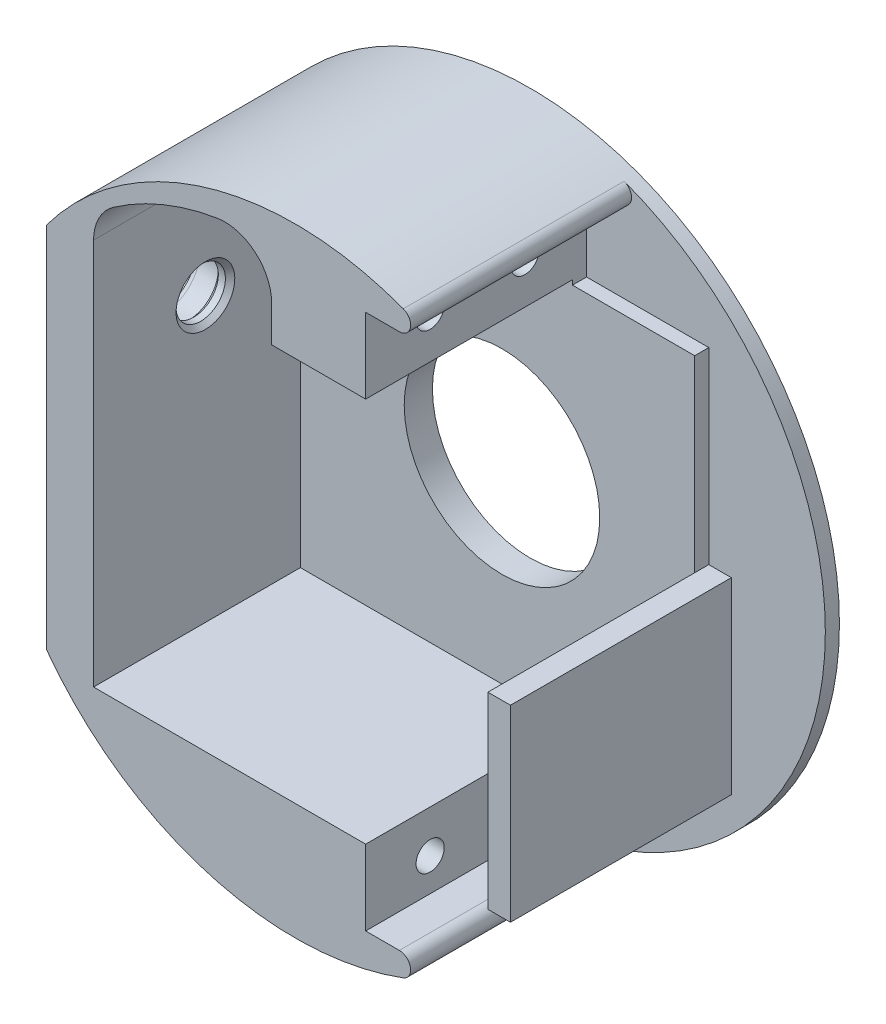
ISO-10303-21;
HEADER;
FILE_DESCRIPTION(('STEP AP214'),'2;1');
FILE_NAME('part.step','',(''),(''),'','','');
FILE_SCHEMA(('AUTOMOTIVE_DESIGN { 1 0 10303 214 1 1 1 1 }'));
ENDSEC;
DATA;
#1=APPLICATION_CONTEXT('core data for automotive mechanical design processes');
#2=APPLICATION_PROTOCOL_DEFINITION('international standard','automotive_design',2000,#1);
#3=PRODUCT_CONTEXT('',#1,'mechanical');
#4=PRODUCT('Part','Part','',(#3));
#5=PRODUCT_RELATED_PRODUCT_CATEGORY('part','',(#4));
#6=PRODUCT_DEFINITION_FORMATION('','',#4);
#7=PRODUCT_DEFINITION_CONTEXT('part definition',#1,'design');
#8=PRODUCT_DEFINITION('design','',#6,#7);
#9=PRODUCT_DEFINITION_SHAPE('','',#8);
#10=(LENGTH_UNIT() NAMED_UNIT(*) SI_UNIT(.MILLI.,.METRE.));
#11=(NAMED_UNIT(*) PLANE_ANGLE_UNIT() SI_UNIT($,.RADIAN.));
#12=(NAMED_UNIT(*) SI_UNIT($,.STERADIAN.) SOLID_ANGLE_UNIT());
#13=UNCERTAINTY_MEASURE_WITH_UNIT(LENGTH_MEASURE(1.E-05),#10,'distance_accuracy_value','');
#14=(GEOMETRIC_REPRESENTATION_CONTEXT(3) GLOBAL_UNCERTAINTY_ASSIGNED_CONTEXT((#13)) GLOBAL_UNIT_ASSIGNED_CONTEXT((#10,
#11,#12)) REPRESENTATION_CONTEXT('',''));
#15=CARTESIAN_POINT('',(0.,0.,0.));
#16=DIRECTION('',(0.,0.,1.));
#17=DIRECTION('',(1.,0.,0.));
#18=AXIS2_PLACEMENT_3D('',#15,#16,#17);
#19=CARTESIAN_POINT('',(9.61999999999999,10.,25.));
#20=DIRECTION('',(0.,0.,-1.));
#21=DIRECTION('',(-1.,0.,0.));
#22=AXIS2_PLACEMENT_3D('',#19,#20,#21);
#23=CYLINDRICAL_SURFACE('',#22,10.4);
#24=CARTESIAN_POINT('',(9.61999999999999,10.,0.));
#25=DIRECTION('',(0.,0.,1.));
#26=DIRECTION('',(1.,0.,0.));
#27=AXIS2_PLACEMENT_3D('',#24,#25,#26);
#28=CIRCLE('',#27,10.4);
#29=CARTESIAN_POINT('',(20.02,10.,0.));
#30=VERTEX_POINT('',#29);
#31=EDGE_CURVE('E348',#30,#30,#28,.T.);
#32=ORIENTED_EDGE('',*,*,#31,.F.);
#33=EDGE_LOOP('',(#32));
#34=FACE_BOUND('',#33,.T.);
#35=CARTESIAN_POINT('',(9.61999999999999,10.,3.));
#36=DIRECTION('',(0.,0.,1.));
#37=DIRECTION('',(1.,0.,0.));
#38=AXIS2_PLACEMENT_3D('',#35,#36,#37);
#39=CIRCLE('',#38,10.4);
#40=CARTESIAN_POINT('',(20.02,10.,3.));
#41=VERTEX_POINT('',#40);
#42=EDGE_CURVE('E260',#41,#41,#39,.T.);
#43=ORIENTED_EDGE('',*,*,#42,.T.);
#44=EDGE_LOOP('',(#43));
#45=FACE_BOUND('',#44,.T.);
#46=ADVANCED_FACE('F36',(#34,#45),#23,.F.);
#47=CARTESIAN_POINT('',(9.61999999999999,10.,25.));
#48=DIRECTION('',(0.,0.,1.));
#49=DIRECTION('',(1.,0.,0.));
#50=AXIS2_PLACEMENT_3D('',#47,#48,#49);
#51=PLANE('',#50);
#52=DIRECTION('',(-1.,0.,0.));
#53=VECTOR('',#52,1.);
#54=CARTESIAN_POINT('',(17.12,38.5,25.));
#55=LINE('',#54,#53);
#56=CARTESIAN_POINT('',(20.7015161417561,38.5,25.));
#57=VERTEX_POINT('',#56);
#58=CARTESIAN_POINT('',(17.12,38.5,25.));
#59=VERTEX_POINT('',#58);
#60=EDGE_CURVE('E308',#57,#59,#55,.T.);
#61=ORIENTED_EDGE('',*,*,#60,.F.);
#62=CARTESIAN_POINT('',(20.7015161417561,39.7,25.));
#63=DIRECTION('',(0.,0.,1.));
#64=DIRECTION('',(1.,0.,0.));
#65=AXIS2_PLACEMENT_3D('',#62,#63,#64);
#66=CIRCLE('',#65,1.2);
#67=CARTESIAN_POINT('',(21.121005711791,40.8242902208202,25.));
#68=VERTEX_POINT('',#67);
#69=EDGE_CURVE('E382',#57,#68,#66,.T.);
#70=ORIENTED_EDGE('',*,*,#69,.T.);
#71=CARTESIAN_POINT('',(9.61999999999999,10.,25.));
#72=DIRECTION('',(0.,0.,1.));
#73=DIRECTION('',(1.,0.,0.));
#74=AXIS2_PLACEMENT_3D('',#71,#72,#73);
#75=CIRCLE('',#74,32.9);
#76=CARTESIAN_POINT('',(-16.8282280902542,29.5678621950863,25.));
#77=VERTEX_POINT('',#76);
#78=EDGE_CURVE('E206',#68,#77,#75,.T.);
#79=ORIENTED_EDGE('',*,*,#78,.T.);
#80=DIRECTION('',(0.,1.,0.));
#81=VECTOR('',#80,1.);
#82=CARTESIAN_POINT('',(-16.8282280902542,-9.56786219508629,25.));
#83=LINE('',#82,#81);
#84=CARTESIAN_POINT('',(-16.8282280902542,-9.56786219508629,25.));
#85=VERTEX_POINT('',#84);
#86=EDGE_CURVE('E253',#85,#77,#83,.T.);
#87=ORIENTED_EDGE('',*,*,#86,.F.);
#88=CARTESIAN_POINT('',(21.121005711791,-20.8242902208202,25.));
#89=VERTEX_POINT('',#88);
#90=EDGE_CURVE('E353',#85,#89,#75,.T.);
#91=ORIENTED_EDGE('',*,*,#90,.T.);
#92=CARTESIAN_POINT('',(20.701516141756,-19.7,25.));
#93=DIRECTION('',(0.,0.,1.));
#94=DIRECTION('',(1.,0.,0.));
#95=AXIS2_PLACEMENT_3D('',#92,#93,#94);
#96=CIRCLE('',#95,1.2);
#97=CARTESIAN_POINT('',(20.701516141756,-18.5,25.));
#98=VERTEX_POINT('',#97);
#99=EDGE_CURVE('E380',#89,#98,#96,.T.);
#100=ORIENTED_EDGE('',*,*,#99,.T.);
#101=DIRECTION('',(1.,0.,0.));
#102=VECTOR('',#101,1.);
#103=CARTESIAN_POINT('',(17.12,-18.5,25.));
#104=LINE('',#103,#102);
#105=CARTESIAN_POINT('',(17.12,-18.5,25.));
#106=VERTEX_POINT('',#105);
#107=EDGE_CURVE('E306',#106,#98,#104,.T.);
#108=ORIENTED_EDGE('',*,*,#107,.F.);
#109=DIRECTION('',(0.,-1.,0.));
#110=VECTOR('',#109,1.);
#111=CARTESIAN_POINT('',(17.12,-10.5,25.));
#112=LINE('',#111,#110);
#113=CARTESIAN_POINT('',(17.12,-10.5,25.));
#114=VERTEX_POINT('',#113);
#115=EDGE_CURVE('E303',#114,#106,#112,.T.);
#116=ORIENTED_EDGE('',*,*,#115,.F.);
#117=DIRECTION('',(1.,0.,0.));
#118=VECTOR('',#117,1.);
#119=CARTESIAN_POINT('',(-11.8282280902542,-10.5,25.));
#120=LINE('',#119,#118);
#121=CARTESIAN_POINT('',(-11.8282280902542,-10.5,25.));
#122=VERTEX_POINT('',#121);
#123=EDGE_CURVE('E300',#122,#114,#120,.T.);
#124=ORIENTED_EDGE('',*,*,#123,.F.);
#125=DIRECTION('',(0.,-1.,0.));
#126=VECTOR('',#125,1.);
#127=CARTESIAN_POINT('',(-11.8282280902542,-10.5,25.));
#128=LINE('',#127,#126);
#129=CARTESIAN_POINT('',(-11.8282280902542,30.6740713678266,25.));
#130=VERTEX_POINT('',#129);
#131=EDGE_CURVE('E292',#130,#122,#128,.T.);
#132=ORIENTED_EDGE('',*,*,#131,.F.);
#133=CARTESIAN_POINT('',(-6.82822809025424,30.6740713678266,25.));
#134=DIRECTION('',(0.,0.,1.));
#135=DIRECTION('',(-1.,0.,0.));
#136=AXIS2_PLACEMENT_3D('',#133,#134,#135);
#137=CIRCLE('',#136,5.);
#138=CARTESIAN_POINT('',(-9.69777366527153,34.7686663652468,25.));
#139=VERTEX_POINT('',#138);
#140=EDGE_CURVE('E325',#139,#130,#137,.T.);
#141=ORIENTED_EDGE('',*,*,#140,.F.);
#142=CARTESIAN_POINT('',(5.74536163142464,12.7326390998653,25.));
#143=DIRECTION('',(0.,0.,1.));
#144=DIRECTION('',(1.,0.,0.));
#145=AXIS2_PLACEMENT_3D('',#142,#143,#144);
#146=CIRCLE('',#145,26.9086775117749);
#147=CARTESIAN_POINT('',(1.2926197006925,39.270348396845,25.));
#148=VERTEX_POINT('',#147);
#149=EDGE_CURVE('E322',#148,#139,#146,.T.);
#150=ORIENTED_EDGE('',*,*,#149,.F.);
#151=CARTESIAN_POINT('',(2.11999999999999,34.3392793605895,25.));
#152=DIRECTION('',(0.,0.,1.));
#153=DIRECTION('',(1.,0.,0.));
#154=AXIS2_PLACEMENT_3D('',#151,#152,#153);
#155=CIRCLE('',#154,5.);
#156=CARTESIAN_POINT('',(7.11999999999999,34.3392793605895,25.));
#157=VERTEX_POINT('',#156);
#158=EDGE_CURVE('E319',#157,#148,#155,.T.);
#159=ORIENTED_EDGE('',*,*,#158,.F.);
#160=DIRECTION('',(0.,1.,0.));
#161=VECTOR('',#160,1.);
#162=CARTESIAN_POINT('',(7.11999999999999,34.3392793605895,25.));
#163=LINE('',#162,#161);
#164=CARTESIAN_POINT('',(7.11999999999999,30.5,25.));
#165=VERTEX_POINT('',#164);
#166=EDGE_CURVE('E316',#165,#157,#163,.T.);
#167=ORIENTED_EDGE('',*,*,#166,.F.);
#168=DIRECTION('',(-1.,0.,0.));
#169=VECTOR('',#168,1.);
#170=CARTESIAN_POINT('',(7.11999999999999,30.5,25.));
#171=LINE('',#170,#169);
#172=CARTESIAN_POINT('',(17.12,30.5,25.));
#173=VERTEX_POINT('',#172);
#174=EDGE_CURVE('E313',#173,#165,#171,.T.);
#175=ORIENTED_EDGE('',*,*,#174,.F.);
#176=DIRECTION('',(0.,-1.,0.));
#177=VECTOR('',#176,1.);
#178=CARTESIAN_POINT('',(17.12,30.5,25.));
#179=LINE('',#178,#177);
#180=EDGE_CURVE('E310',#59,#173,#179,.T.);
#181=ORIENTED_EDGE('',*,*,#180,.F.);
#182=EDGE_LOOP('',(#61,#70,#79,#87,#91,#100,#108,#116,#124,#132,#141,#150,#159,#167,#175,#181));
#183=FACE_BOUND('',#182,.T.);
#184=ADVANCED_FACE('F408',(#183),#51,.T.);
#185=CARTESIAN_POINT('',(9.61999999999999,10.,0.));
#186=DIRECTION('',(0.,0.,1.));
#187=DIRECTION('',(1.,0.,0.));
#188=AXIS2_PLACEMENT_3D('',#185,#186,#187);
#189=PLANE('',#188);
#190=CARTESIAN_POINT('',(9.61999999999999,10.,0.));
#191=DIRECTION('',(0.,0.,1.));
#192=DIRECTION('',(1.,0.,0.));
#193=AXIS2_PLACEMENT_3D('',#190,#191,#192);
#194=CIRCLE('',#193,32.9);
#195=CARTESIAN_POINT('',(42.52,10.,0.));
#196=VERTEX_POINT('',#195);
#197=EDGE_CURVE('E351',#196,#196,#194,.T.);
#198=ORIENTED_EDGE('',*,*,#197,.F.);
#199=EDGE_LOOP('',(#198));
#200=FACE_BOUND('',#199,.T.);
#201=ORIENTED_EDGE('',*,*,#31,.T.);
#202=EDGE_LOOP('',(#201));
#203=FACE_BOUND('',#202,.T.);
#204=ADVANCED_FACE('F441',(#200,#203),#189,.F.);
#205=CARTESIAN_POINT('',(9.61999999999999,10.,25.));
#206=DIRECTION('',(0.,0.,-1.));
#207=DIRECTION('',(-1.,0.,0.));
#208=AXIS2_PLACEMENT_3D('',#205,#206,#207);
#209=CYLINDRICAL_SURFACE('',#208,32.9);
#210=ORIENTED_EDGE('',*,*,#78,.F.);
#211=DIRECTION('',(0.,0.,-1.));
#212=VECTOR('',#211,1.);
#213=CARTESIAN_POINT('',(21.121005711791,40.8242902208202,25.));
#214=LINE('',#213,#212);
#215=CARTESIAN_POINT('',(21.121005711791,40.8242902208202,1.5));
#216=VERTEX_POINT('',#215);
#217=EDGE_CURVE('E387',#68,#216,#214,.T.);
#218=ORIENTED_EDGE('',*,*,#217,.T.);
#219=CARTESIAN_POINT('',(9.61999999999999,10.,1.5));
#220=DIRECTION('',(0.,0.,1.));
#221=DIRECTION('',(1.,0.,0.));
#222=AXIS2_PLACEMENT_3D('',#219,#220,#221);
#223=CIRCLE('',#222,32.9);
#224=CARTESIAN_POINT('',(21.121005711791,-20.8242902208202,1.5));
#225=VERTEX_POINT('',#224);
#226=EDGE_CURVE('E58',#216,#225,#223,.F.);
#227=ORIENTED_EDGE('',*,*,#226,.T.);
#228=DIRECTION('',(0.,0.,-1.));
#229=VECTOR('',#228,1.);
#230=CARTESIAN_POINT('',(21.121005711791,-20.8242902208202,25.));
#231=LINE('',#230,#229);
#232=EDGE_CURVE('E384',#225,#89,#231,.F.);
#233=ORIENTED_EDGE('',*,*,#232,.T.);
#234=ORIENTED_EDGE('',*,*,#90,.F.);
#235=DIRECTION('',(0.,0.,1.));
#236=VECTOR('',#235,1.);
#237=CARTESIAN_POINT('',(-16.8282280902542,-9.56786219508629,-79.3669461016525));
#238=LINE('',#237,#236);
#239=CARTESIAN_POINT('',(-16.8282280902542,-9.56786219508629,1.5));
#240=VERTEX_POINT('',#239);
#241=EDGE_CURVE('E256',#240,#85,#238,.T.);
#242=ORIENTED_EDGE('',*,*,#241,.F.);
#243=CARTESIAN_POINT('',(9.61999999999999,10.,1.5));
#244=DIRECTION('',(0.,0.,1.));
#245=DIRECTION('',(1.,0.,0.));
#246=AXIS2_PLACEMENT_3D('',#243,#244,#245);
#247=CIRCLE('',#246,32.9);
#248=CARTESIAN_POINT('',(-16.8282280902542,29.5678621950863,1.5));
#249=VERTEX_POINT('',#248);
#250=EDGE_CURVE('E231',#240,#249,#247,.F.);
#251=ORIENTED_EDGE('',*,*,#250,.T.);
#252=DIRECTION('',(0.,0.,1.));
#253=VECTOR('',#252,1.);
#254=CARTESIAN_POINT('',(-16.8282280902542,29.5678621950863,-79.3669461016525));
#255=LINE('',#254,#253);
#256=EDGE_CURVE('E257',#249,#77,#255,.T.);
#257=ORIENTED_EDGE('',*,*,#256,.T.);
#258=EDGE_LOOP('',(#210,#218,#227,#233,#234,#242,#251,#257));
#259=FACE_BOUND('',#258,.T.);
#260=ORIENTED_EDGE('',*,*,#197,.T.);
#261=EDGE_LOOP('',(#260));
#262=FACE_BOUND('',#261,.T.);
#263=ADVANCED_FACE('F412',(#259,#262),#209,.T.);
#264=CARTESIAN_POINT('',(-11.8282280902542,-10.5,-79.3669461016525));
#265=DIRECTION('',(0.,-1.,0.));
#266=DIRECTION('',(0.,0.,-1.));
#267=AXIS2_PLACEMENT_3D('',#264,#265,#266);
#268=PLANE('',#267);
#269=DIRECTION('',(-1.,0.,0.));
#270=VECTOR('',#269,1.);
#271=CARTESIAN_POINT('',(-11.8282280902542,-10.5,3.));
#272=LINE('',#271,#270);
#273=CARTESIAN_POINT('',(17.1200000000007,-10.5,3.));
#274=VERTEX_POINT('',#273);
#275=CARTESIAN_POINT('',(-11.8282280902542,-10.5,3.));
#276=VERTEX_POINT('',#275);
#277=EDGE_CURVE('E224',#274,#276,#272,.T.);
#278=ORIENTED_EDGE('',*,*,#277,.T.);
#279=DIRECTION('',(0.,0.,1.));
#280=VECTOR('',#279,1.);
#281=CARTESIAN_POINT('',(-11.8282280902542,-10.5,-79.3669461016525));
#282=LINE('',#281,#280);
#283=EDGE_CURVE('E328',#276,#122,#282,.T.);
#284=ORIENTED_EDGE('',*,*,#283,.T.);
#285=ORIENTED_EDGE('',*,*,#123,.T.);
#286=DIRECTION('',(0.,0.,1.));
#287=VECTOR('',#286,1.);
#288=CARTESIAN_POINT('',(17.12,-10.5,-79.3669461016525));
#289=LINE('',#288,#287);
#290=EDGE_CURVE('E345',#274,#114,#289,.T.);
#291=ORIENTED_EDGE('',*,*,#290,.F.);
#292=EDGE_LOOP('',(#278,#284,#285,#291));
#293=FACE_BOUND('',#292,.T.);
#294=ADVANCED_FACE('F453',(#293),#268,.F.);
#295=CARTESIAN_POINT('',(17.12,-10.5,-79.3669461016525));
#296=DIRECTION('',(-1.,0.,0.));
#297=DIRECTION('',(0.,-1.,0.));
#298=AXIS2_PLACEMENT_3D('',#295,#296,#297);
#299=PLANE('',#298);
#300=CARTESIAN_POINT('',(17.12,-15.0000000000002,8.06000000000017));
#301=DIRECTION('',(1.,0.,0.));
#302=DIRECTION('',(0.,1.,0.));
#303=AXIS2_PLACEMENT_3D('',#300,#301,#302);
#304=CIRCLE('',#303,1.5);
#305=CARTESIAN_POINT('',(17.12,-13.5000000000002,8.06000000000017));
#306=VERTEX_POINT('',#305);
#307=EDGE_CURVE('E601',#306,#306,#304,.T.);
#308=ORIENTED_EDGE('',*,*,#307,.F.);
#309=EDGE_LOOP('',(#308));
#310=FACE_BOUND('',#309,.T.);
#311=CARTESIAN_POINT('',(17.12,-15.0000000000001,18.1400000000002));
#312=DIRECTION('',(1.,0.,0.));
#313=DIRECTION('',(0.,1.,0.));
#314=AXIS2_PLACEMENT_3D('',#311,#312,#313);
#315=CIRCLE('',#314,1.5);
#316=CARTESIAN_POINT('',(17.12,-13.5000000000001,18.1400000000002));
#317=VERTEX_POINT('',#316);
#318=EDGE_CURVE('E588',#317,#317,#315,.T.);
#319=ORIENTED_EDGE('',*,*,#318,.F.);
#320=EDGE_LOOP('',(#319));
#321=FACE_BOUND('',#320,.T.);
#322=DIRECTION('',(0.,0.,1.));
#323=VECTOR('',#322,1.);
#324=CARTESIAN_POINT('',(17.12,-18.5,-79.3669461016525));
#325=LINE('',#324,#323);
#326=CARTESIAN_POINT('',(17.12,-18.5,1.5));
#327=VERTEX_POINT('',#326);
#328=EDGE_CURVE('E343',#327,#106,#325,.T.);
#329=ORIENTED_EDGE('',*,*,#328,.F.);
#330=DIRECTION('',(0.,1.,0.));
#331=VECTOR('',#330,1.);
#332=CARTESIAN_POINT('',(17.1200000000007,-10.0000000000002,1.5));
#333=LINE('',#332,#331);
#334=CARTESIAN_POINT('',(17.1200000000007,-10.0000000000002,1.5));
#335=VERTEX_POINT('',#334);
#336=EDGE_CURVE('E214',#327,#335,#333,.T.);
#337=ORIENTED_EDGE('',*,*,#336,.T.);
#338=DIRECTION('',(0.,0.,1.));
#339=VECTOR('',#338,1.);
#340=CARTESIAN_POINT('',(17.1200000000007,-10.0000000000002,-62.4032050458949));
#341=LINE('',#340,#339);
#342=CARTESIAN_POINT('',(17.1200000000007,-10.0000000000002,3.));
#343=VERTEX_POINT('',#342);
#344=EDGE_CURVE('E198',#335,#343,#341,.T.);
#345=ORIENTED_EDGE('',*,*,#344,.T.);
#346=DIRECTION('',(0.,-1.,0.));
#347=VECTOR('',#346,1.);
#348=CARTESIAN_POINT('',(17.1200000000007,-10.0000000000002,3.));
#349=LINE('',#348,#347);
#350=EDGE_CURVE('E211',#343,#274,#349,.T.);
#351=ORIENTED_EDGE('',*,*,#350,.T.);
#352=ORIENTED_EDGE('',*,*,#290,.T.);
#353=ORIENTED_EDGE('',*,*,#115,.T.);
#354=EDGE_LOOP('',(#329,#337,#345,#351,#352,#353));
#355=FACE_BOUND('',#354,.T.);
#356=ADVANCED_FACE('F210',(#310,#321,#355),#299,.F.);
#357=CARTESIAN_POINT('',(17.12,-18.5,-79.3669461016525));
#358=DIRECTION('',(0.,-1.,0.));
#359=DIRECTION('',(0.,0.,-1.));
#360=AXIS2_PLACEMENT_3D('',#357,#358,#359);
#361=PLANE('',#360);
#362=ORIENTED_EDGE('',*,*,#107,.T.);
#363=DIRECTION('',(0.,0.,-1.));
#364=VECTOR('',#363,1.);
#365=CARTESIAN_POINT('',(20.701516141756,-18.5,-79.3669461016525));
#366=LINE('',#365,#364);
#367=CARTESIAN_POINT('',(20.701516141756,-18.5,1.5));
#368=VERTEX_POINT('',#367);
#369=EDGE_CURVE('E51',#98,#368,#366,.T.);
#370=ORIENTED_EDGE('',*,*,#369,.T.);
#371=DIRECTION('',(-1.,0.,0.));
#372=VECTOR('',#371,1.);
#373=CARTESIAN_POINT('',(17.12,-18.5,1.5));
#374=LINE('',#373,#372);
#375=EDGE_CURVE('E567',#368,#327,#374,.T.);
#376=ORIENTED_EDGE('',*,*,#375,.T.);
#377=ORIENTED_EDGE('',*,*,#328,.T.);
#378=EDGE_LOOP('',(#362,#370,#376,#377));
#379=FACE_BOUND('',#378,.T.);
#380=ADVANCED_FACE('F564',(#379),#361,.F.);
#381=CARTESIAN_POINT('',(17.12,38.5,-79.3669461016525));
#382=DIRECTION('',(0.,1.,0.));
#383=DIRECTION('',(-1.,0.,0.));
#384=AXIS2_PLACEMENT_3D('',#381,#382,#383);
#385=PLANE('',#384);
#386=DIRECTION('',(1.,0.,0.));
#387=VECTOR('',#386,1.);
#388=CARTESIAN_POINT('',(17.12,38.5,1.5));
#389=LINE('',#388,#387);
#390=CARTESIAN_POINT('',(17.12,38.5,1.5));
#391=VERTEX_POINT('',#390);
#392=CARTESIAN_POINT('',(20.7015161417561,38.5,1.5));
#393=VERTEX_POINT('',#392);
#394=EDGE_CURVE('E395',#391,#393,#389,.T.);
#395=ORIENTED_EDGE('',*,*,#394,.T.);
#396=DIRECTION('',(0.,0.,-1.));
#397=VECTOR('',#396,1.);
#398=CARTESIAN_POINT('',(20.7015161417561,38.5,-79.3669461016525));
#399=LINE('',#398,#397);
#400=EDGE_CURVE('E377',#393,#57,#399,.F.);
#401=ORIENTED_EDGE('',*,*,#400,.T.);
#402=ORIENTED_EDGE('',*,*,#60,.T.);
#403=DIRECTION('',(0.,0.,1.));
#404=VECTOR('',#403,1.);
#405=CARTESIAN_POINT('',(17.12,38.5,-79.3669461016525));
#406=LINE('',#405,#404);
#407=EDGE_CURVE('E340',#391,#59,#406,.T.);
#408=ORIENTED_EDGE('',*,*,#407,.F.);
#409=EDGE_LOOP('',(#395,#401,#402,#408));
#410=FACE_BOUND('',#409,.T.);
#411=ADVANCED_FACE('F400',(#410),#385,.F.);
#412=CARTESIAN_POINT('',(17.12,30.5,-79.3669461016525));
#413=DIRECTION('',(-1.,0.,0.));
#414=DIRECTION('',(0.,0.,1.));
#415=AXIS2_PLACEMENT_3D('',#412,#413,#414);
#416=PLANE('',#415);
#417=CARTESIAN_POINT('',(17.12,34.9999999999999,18.14));
#418=DIRECTION('',(1.,0.,0.));
#419=DIRECTION('',(0.,1.,0.));
#420=AXIS2_PLACEMENT_3D('',#417,#418,#419);
#421=CIRCLE('',#420,1.5);
#422=CARTESIAN_POINT('',(17.12,36.4999999999999,18.14));
#423=VERTEX_POINT('',#422);
#424=EDGE_CURVE('E594',#423,#423,#421,.T.);
#425=ORIENTED_EDGE('',*,*,#424,.F.);
#426=EDGE_LOOP('',(#425));
#427=FACE_BOUND('',#426,.T.);
#428=CARTESIAN_POINT('',(17.12,34.9999999999998,8.05999999999999));
#429=DIRECTION('',(1.,0.,0.));
#430=DIRECTION('',(0.,1.,0.));
#431=AXIS2_PLACEMENT_3D('',#428,#429,#430);
#432=CIRCLE('',#431,1.5);
#433=CARTESIAN_POINT('',(17.12,36.4999999999998,8.05999999999999));
#434=VERTEX_POINT('',#433);
#435=EDGE_CURVE('E605',#434,#434,#432,.T.);
#436=ORIENTED_EDGE('',*,*,#435,.F.);
#437=EDGE_LOOP('',(#436));
#438=FACE_BOUND('',#437,.T.);
#439=DIRECTION('',(0.,0.,1.));
#440=VECTOR('',#439,1.);
#441=CARTESIAN_POINT('',(17.12,30.5,-79.3669461016525));
#442=LINE('',#441,#440);
#443=CARTESIAN_POINT('',(17.12,30.5,3.));
#444=VERTEX_POINT('',#443);
#445=EDGE_CURVE('E338',#444,#173,#442,.T.);
#446=ORIENTED_EDGE('',*,*,#445,.F.);
#447=DIRECTION('',(0.,-1.,0.));
#448=VECTOR('',#447,1.);
#449=CARTESIAN_POINT('',(17.12,10.,3.));
#450=LINE('',#449,#448);
#451=CARTESIAN_POINT('',(17.12,29.9999999999998,3.));
#452=VERTEX_POINT('',#451);
#453=EDGE_CURVE('E205',#444,#452,#450,.T.);
#454=ORIENTED_EDGE('',*,*,#453,.T.);
#455=DIRECTION('',(0.,0.,1.));
#456=VECTOR('',#455,1.);
#457=CARTESIAN_POINT('',(17.12,29.9999999999998,-62.4032050458949));
#458=LINE('',#457,#456);
#459=CARTESIAN_POINT('',(17.12,29.9999999999998,1.5));
#460=VERTEX_POINT('',#459);
#461=EDGE_CURVE('E216',#460,#452,#458,.T.);
#462=ORIENTED_EDGE('',*,*,#461,.F.);
#463=DIRECTION('',(0.,1.,0.));
#464=VECTOR('',#463,1.);
#465=CARTESIAN_POINT('',(17.12,38.5,1.5));
#466=LINE('',#465,#464);
#467=EDGE_CURVE('E403',#460,#391,#466,.T.);
#468=ORIENTED_EDGE('',*,*,#467,.T.);
#469=ORIENTED_EDGE('',*,*,#407,.T.);
#470=ORIENTED_EDGE('',*,*,#180,.T.);
#471=EDGE_LOOP('',(#446,#454,#462,#468,#469,#470));
#472=FACE_BOUND('',#471,.T.);
#473=ADVANCED_FACE('F530',(#427,#438,#472),#416,.F.);
#474=CARTESIAN_POINT('',(7.11999999999999,30.5,-79.3669461016525));
#475=DIRECTION('',(0.,1.,0.));
#476=DIRECTION('',(0.,0.,1.));
#477=AXIS2_PLACEMENT_3D('',#474,#475,#476);
#478=PLANE('',#477);
#479=DIRECTION('',(1.,0.,0.));
#480=VECTOR('',#479,1.);
#481=CARTESIAN_POINT('',(7.11999999999999,30.5,3.));
#482=LINE('',#481,#480);
#483=CARTESIAN_POINT('',(7.11999999999999,30.5,3.));
#484=VERTEX_POINT('',#483);
#485=EDGE_CURVE('E266',#484,#444,#482,.T.);
#486=ORIENTED_EDGE('',*,*,#485,.T.);
#487=ORIENTED_EDGE('',*,*,#445,.T.);
#488=ORIENTED_EDGE('',*,*,#174,.T.);
#489=DIRECTION('',(0.,0.,1.));
#490=VECTOR('',#489,1.);
#491=CARTESIAN_POINT('',(7.11999999999999,30.5,-79.3669461016525));
#492=LINE('',#491,#490);
#493=EDGE_CURVE('E336',#484,#165,#492,.T.);
#494=ORIENTED_EDGE('',*,*,#493,.F.);
#495=EDGE_LOOP('',(#486,#487,#488,#494));
#496=FACE_BOUND('',#495,.T.);
#497=ADVANCED_FACE('F535',(#496),#478,.F.);
#498=CARTESIAN_POINT('',(7.11999999999999,34.3392793605895,-79.3669461016525));
#499=DIRECTION('',(1.,0.,0.));
#500=DIRECTION('',(0.,0.,-1.));
#501=AXIS2_PLACEMENT_3D('',#498,#499,#500);
#502=PLANE('',#501);
#503=DIRECTION('',(0.,-1.,0.));
#504=VECTOR('',#503,1.);
#505=CARTESIAN_POINT('',(7.11999999999999,34.3392793605895,3.));
#506=LINE('',#505,#504);
#507=CARTESIAN_POINT('',(7.11999999999999,34.3392793605895,3.));
#508=VERTEX_POINT('',#507);
#509=EDGE_CURVE('E269',#508,#484,#506,.T.);
#510=ORIENTED_EDGE('',*,*,#509,.T.);
#511=ORIENTED_EDGE('',*,*,#493,.T.);
#512=ORIENTED_EDGE('',*,*,#166,.T.);
#513=DIRECTION('',(0.,0.,1.));
#514=VECTOR('',#513,1.);
#515=CARTESIAN_POINT('',(7.11999999999999,34.3392793605895,-79.3669461016525));
#516=LINE('',#515,#514);
#517=EDGE_CURVE('E334',#508,#157,#516,.T.);
#518=ORIENTED_EDGE('',*,*,#517,.F.);
#519=EDGE_LOOP('',(#510,#511,#512,#518));
#520=FACE_BOUND('',#519,.T.);
#521=ADVANCED_FACE('F539',(#520),#502,.F.);
#522=CARTESIAN_POINT('',(2.11999999999999,34.3392793605895,-79.3669461016525));
#523=DIRECTION('',(0.,0.,1.));
#524=DIRECTION('',(1.,0.,0.));
#525=AXIS2_PLACEMENT_3D('',#522,#523,#524);
#526=CYLINDRICAL_SURFACE('',#525,5.);
#527=CARTESIAN_POINT('',(2.11999999999999,34.3392793605895,3.));
#528=DIRECTION('',(0.,0.,1.));
#529=DIRECTION('',(1.,0.,0.));
#530=AXIS2_PLACEMENT_3D('',#527,#528,#529);
#531=CIRCLE('',#530,5.);
#532=CARTESIAN_POINT('',(1.2926197006925,39.270348396845,3.));
#533=VERTEX_POINT('',#532);
#534=EDGE_CURVE('E272',#533,#508,#531,.F.);
#535=ORIENTED_EDGE('',*,*,#534,.T.);
#536=ORIENTED_EDGE('',*,*,#517,.T.);
#537=ORIENTED_EDGE('',*,*,#158,.T.);
#538=DIRECTION('',(0.,0.,1.));
#539=VECTOR('',#538,1.);
#540=CARTESIAN_POINT('',(1.2926197006925,39.270348396845,-79.3669461016525));
#541=LINE('',#540,#539);
#542=EDGE_CURVE('E332',#533,#148,#541,.T.);
#543=ORIENTED_EDGE('',*,*,#542,.F.);
#544=EDGE_LOOP('',(#535,#536,#537,#543));
#545=FACE_BOUND('',#544,.T.);
#546=ADVANCED_FACE('F548',(#545),#526,.F.);
#547=CARTESIAN_POINT('',(5.74536163142464,12.7326390998653,-79.3669461016525));
#548=DIRECTION('',(0.,0.,1.));
#549=DIRECTION('',(1.,0.,0.));
#550=AXIS2_PLACEMENT_3D('',#547,#548,#549);
#551=CYLINDRICAL_SURFACE('',#550,26.9086775117749);
#552=CARTESIAN_POINT('',(5.74536163142464,12.7326390998653,3.));
#553=DIRECTION('',(0.,0.,1.));
#554=DIRECTION('',(1.,0.,0.));
#555=AXIS2_PLACEMENT_3D('',#552,#553,#554);
#556=CIRCLE('',#555,26.9086775117749);
#557=CARTESIAN_POINT('',(-9.69777366527153,34.7686663652468,3.));
#558=VERTEX_POINT('',#557);
#559=EDGE_CURVE('E274',#558,#533,#556,.F.);
#560=ORIENTED_EDGE('',*,*,#559,.T.);
#561=ORIENTED_EDGE('',*,*,#542,.T.);
#562=ORIENTED_EDGE('',*,*,#149,.T.);
#563=DIRECTION('',(0.,0.,1.));
#564=VECTOR('',#563,1.);
#565=CARTESIAN_POINT('',(-9.69777366527153,34.7686663652468,-79.3669461016525));
#566=LINE('',#565,#564);
#567=EDGE_CURVE('E330',#558,#139,#566,.T.);
#568=ORIENTED_EDGE('',*,*,#567,.F.);
#569=EDGE_LOOP('',(#560,#561,#562,#568));
#570=FACE_BOUND('',#569,.T.);
#571=ADVANCED_FACE('F551',(#570),#551,.F.);
#572=CARTESIAN_POINT('',(-6.82822809025424,30.6740713678266,-79.3669461016525));
#573=DIRECTION('',(0.,0.,1.));
#574=DIRECTION('',(1.,0.,0.));
#575=AXIS2_PLACEMENT_3D('',#572,#573,#574);
#576=CYLINDRICAL_SURFACE('',#575,5.);
#577=CARTESIAN_POINT('',(-6.82822809025424,30.6740713678266,3.));
#578=DIRECTION('',(0.,0.,1.));
#579=DIRECTION('',(1.,0.,0.));
#580=AXIS2_PLACEMENT_3D('',#577,#578,#579);
#581=CIRCLE('',#580,5.);
#582=CARTESIAN_POINT('',(-11.8282280902542,30.6740713678266,3.));
#583=VERTEX_POINT('',#582);
#584=EDGE_CURVE('E276',#583,#558,#581,.F.);
#585=ORIENTED_EDGE('',*,*,#584,.T.);
#586=ORIENTED_EDGE('',*,*,#567,.T.);
#587=ORIENTED_EDGE('',*,*,#140,.T.);
#588=DIRECTION('',(0.,0.,1.));
#589=VECTOR('',#588,1.);
#590=CARTESIAN_POINT('',(-11.8282280902542,30.6740713678266,-79.3669461016525));
#591=LINE('',#590,#589);
#592=EDGE_CURVE('E270',#583,#130,#591,.T.);
#593=ORIENTED_EDGE('',*,*,#592,.F.);
#594=EDGE_LOOP('',(#585,#586,#587,#593));
#595=FACE_BOUND('',#594,.T.);
#596=ADVANCED_FACE('F554',(#595),#576,.F.);
#597=CARTESIAN_POINT('',(-11.8282280902542,-10.5,-79.3669461016525));
#598=DIRECTION('',(-1.,0.,0.));
#599=DIRECTION('',(0.,-1.,0.));
#600=AXIS2_PLACEMENT_3D('',#597,#598,#599);
#601=PLANE('',#600);
#602=CARTESIAN_POINT('',(-11.8282280902542,19.6199999999999,13.1));
#603=DIRECTION('',(-1.,0.,0.));
#604=DIRECTION('',(0.,-1.,0.));
#605=AXIS2_PLACEMENT_3D('',#602,#603,#604);
#606=CIRCLE('',#605,3.125);
#607=CARTESIAN_POINT('',(-11.8282280902542,16.4949999999999,13.1));
#608=VERTEX_POINT('',#607);
#609=EDGE_CURVE('E371',#608,#608,#606,.T.);
#610=ORIENTED_EDGE('',*,*,#609,.T.);
#611=EDGE_LOOP('',(#610));
#612=FACE_BOUND('',#611,.T.);
#613=DIRECTION('',(0.,1.,0.));
#614=VECTOR('',#613,1.);
#615=CARTESIAN_POINT('',(-11.8282280902542,-10.5,3.));
#616=LINE('',#615,#614);
#617=EDGE_CURVE('E264',#276,#583,#616,.T.);
#618=ORIENTED_EDGE('',*,*,#617,.T.);
#619=ORIENTED_EDGE('',*,*,#592,.T.);
#620=ORIENTED_EDGE('',*,*,#131,.T.);
#621=ORIENTED_EDGE('',*,*,#283,.F.);
#622=EDGE_LOOP('',(#618,#619,#620,#621));
#623=FACE_BOUND('',#622,.T.);
#624=ADVANCED_FACE('F445',(#612,#623),#601,.F.);
#625=CARTESIAN_POINT('',(30.12,-10.,-79.3669461016525));
#626=DIRECTION('',(0.,-1.,0.));
#627=DIRECTION('',(0.,0.,-1.));
#628=AXIS2_PLACEMENT_3D('',#625,#626,#627);
#629=PLANE('',#628);
#630=DIRECTION('',(0.,0.,1.));
#631=VECTOR('',#630,1.);
#632=CARTESIAN_POINT('',(32.52,-10.,-79.3669461016525));
#633=LINE('',#632,#631);
#634=CARTESIAN_POINT('',(32.52,-10.,1.5));
#635=VERTEX_POINT('',#634);
#636=CARTESIAN_POINT('',(32.52,-10.,25.));
#637=VERTEX_POINT('',#636);
#638=EDGE_CURVE('E295',#635,#637,#633,.T.);
#639=ORIENTED_EDGE('',*,*,#638,.T.);
#640=DIRECTION('',(1.,0.,0.));
#641=VECTOR('',#640,1.);
#642=CARTESIAN_POINT('',(30.12,-10.,25.));
#643=LINE('',#642,#641);
#644=CARTESIAN_POINT('',(30.12,-10.,25.));
#645=VERTEX_POINT('',#644);
#646=EDGE_CURVE('E281',#645,#637,#643,.T.);
#647=ORIENTED_EDGE('',*,*,#646,.F.);
#648=DIRECTION('',(0.,0.,1.));
#649=VECTOR('',#648,1.);
#650=CARTESIAN_POINT('',(30.12,-10.,-79.3669461016525));
#651=LINE('',#650,#649);
#652=CARTESIAN_POINT('',(30.12,-10.,3.));
#653=VERTEX_POINT('',#652);
#654=EDGE_CURVE('E200',#653,#645,#651,.T.);
#655=ORIENTED_EDGE('',*,*,#654,.F.);
#656=DIRECTION('',(-1.,0.,0.));
#657=VECTOR('',#656,1.);
#658=CARTESIAN_POINT('',(9.62000000000022,-10.0000000000003,3.));
#659=LINE('',#658,#657);
#660=EDGE_CURVE('E194',#653,#343,#659,.T.);
#661=ORIENTED_EDGE('',*,*,#660,.T.);
#662=ORIENTED_EDGE('',*,*,#344,.F.);
#663=DIRECTION('',(1.,0.,0.));
#664=VECTOR('',#663,1.);
#665=CARTESIAN_POINT('',(32.52,-10.,1.5));
#666=LINE('',#665,#664);
#667=EDGE_CURVE('E241',#335,#635,#666,.T.);
#668=ORIENTED_EDGE('',*,*,#667,.T.);
#669=EDGE_LOOP('',(#639,#647,#655,#661,#662,#668));
#670=FACE_BOUND('',#669,.T.);
#671=ADVANCED_FACE('F196',(#670),#629,.T.);
#672=CARTESIAN_POINT('',(32.52,-10.,-79.3669461016525));
#673=DIRECTION('',(1.,0.,0.));
#674=DIRECTION('',(0.,1.,0.));
#675=AXIS2_PLACEMENT_3D('',#672,#673,#674);
#676=PLANE('',#675);
#677=DIRECTION('',(0.,0.,1.));
#678=VECTOR('',#677,1.);
#679=CARTESIAN_POINT('',(32.52,10.,-79.3669461016525));
#680=LINE('',#679,#678);
#681=CARTESIAN_POINT('',(32.52,10.,1.5));
#682=VERTEX_POINT('',#681);
#683=CARTESIAN_POINT('',(32.52,10.,25.));
#684=VERTEX_POINT('',#683);
#685=EDGE_CURVE('E293',#682,#684,#680,.T.);
#686=ORIENTED_EDGE('',*,*,#685,.T.);
#687=DIRECTION('',(0.,1.,0.));
#688=VECTOR('',#687,1.);
#689=CARTESIAN_POINT('',(32.52,-10.,25.));
#690=LINE('',#689,#688);
#691=EDGE_CURVE('E284',#637,#684,#690,.T.);
#692=ORIENTED_EDGE('',*,*,#691,.F.);
#693=ORIENTED_EDGE('',*,*,#638,.F.);
#694=DIRECTION('',(0.,1.,0.));
#695=VECTOR('',#694,1.);
#696=CARTESIAN_POINT('',(32.52,10.,1.5));
#697=LINE('',#696,#695);
#698=EDGE_CURVE('E246',#635,#682,#697,.T.);
#699=ORIENTED_EDGE('',*,*,#698,.T.);
#700=EDGE_LOOP('',(#686,#692,#693,#699));
#701=FACE_BOUND('',#700,.T.);
#702=ADVANCED_FACE('F583',(#701),#676,.T.);
#703=CARTESIAN_POINT('',(30.12,10.,-79.3669461016525));
#704=DIRECTION('',(0.,1.,0.));
#705=DIRECTION('',(0.,0.,1.));
#706=AXIS2_PLACEMENT_3D('',#703,#704,#705);
#707=PLANE('',#706);
#708=DIRECTION('',(0.,0.,1.));
#709=VECTOR('',#708,1.);
#710=CARTESIAN_POINT('',(30.12,10.,-79.3669461016525));
#711=LINE('',#710,#709);
#712=CARTESIAN_POINT('',(30.12,10.,3.));
#713=VERTEX_POINT('',#712);
#714=CARTESIAN_POINT('',(30.12,10.,25.));
#715=VERTEX_POINT('',#714);
#716=EDGE_CURVE('E290',#713,#715,#711,.T.);
#717=ORIENTED_EDGE('',*,*,#716,.T.);
#718=DIRECTION('',(-1.,0.,0.));
#719=VECTOR('',#718,1.);
#720=CARTESIAN_POINT('',(30.12,10.,25.));
#721=LINE('',#720,#719);
#722=EDGE_CURVE('E287',#684,#715,#721,.T.);
#723=ORIENTED_EDGE('',*,*,#722,.F.);
#724=ORIENTED_EDGE('',*,*,#685,.F.);
#725=DIRECTION('',(-1.,0.,0.));
#726=VECTOR('',#725,1.);
#727=CARTESIAN_POINT('',(30.12,10.,1.5));
#728=LINE('',#727,#726);
#729=CARTESIAN_POINT('',(30.12,10.,1.5));
#730=VERTEX_POINT('',#729);
#731=EDGE_CURVE('E234',#682,#730,#728,.T.);
#732=ORIENTED_EDGE('',*,*,#731,.T.);
#733=DIRECTION('',(0.,0.,1.));
#734=VECTOR('',#733,1.);
#735=CARTESIAN_POINT('',(30.12,10.,-62.4032050458949));
#736=LINE('',#735,#734);
#737=EDGE_CURVE('E239',#730,#713,#736,.T.);
#738=ORIENTED_EDGE('',*,*,#737,.T.);
#739=EDGE_LOOP('',(#717,#723,#724,#732,#738));
#740=FACE_BOUND('',#739,.T.);
#741=ADVANCED_FACE('F574',(#740),#707,.T.);
#742=CARTESIAN_POINT('',(30.12,-10.,-79.3669461016525));
#743=DIRECTION('',(-1.,0.,0.));
#744=DIRECTION('',(0.,-1.,0.));
#745=AXIS2_PLACEMENT_3D('',#742,#743,#744);
#746=PLANE('',#745);
#747=ORIENTED_EDGE('',*,*,#654,.T.);
#748=DIRECTION('',(0.,-1.,0.));
#749=VECTOR('',#748,1.);
#750=CARTESIAN_POINT('',(30.12,-10.,25.));
#751=LINE('',#750,#749);
#752=EDGE_CURVE('E249',#715,#645,#751,.T.);
#753=ORIENTED_EDGE('',*,*,#752,.F.);
#754=ORIENTED_EDGE('',*,*,#716,.F.);
#755=DIRECTION('',(0.,1.,0.));
#756=VECTOR('',#755,1.);
#757=CARTESIAN_POINT('',(30.12,-10.,3.));
#758=LINE('',#757,#756);
#759=EDGE_CURVE('E262',#653,#713,#758,.T.);
#760=ORIENTED_EDGE('',*,*,#759,.F.);
#761=EDGE_LOOP('',(#747,#753,#754,#760));
#762=FACE_BOUND('',#761,.T.);
#763=ADVANCED_FACE('F580',(#762),#746,.T.);
#764=CARTESIAN_POINT('',(9.61999999999999,10.,3.));
#765=DIRECTION('',(0.,0.,1.));
#766=DIRECTION('',(1.,0.,0.));
#767=AXIS2_PLACEMENT_3D('',#764,#765,#766);
#768=PLANE('',#767);
#769=DIRECTION('',(0.,-1.,0.));
#770=VECTOR('',#769,1.);
#771=CARTESIAN_POINT('',(30.12,10.,3.));
#772=LINE('',#771,#770);
#773=CARTESIAN_POINT('',(30.12,29.9999999999998,3.));
#774=VERTEX_POINT('',#773);
#775=EDGE_CURVE('E217',#774,#713,#772,.T.);
#776=ORIENTED_EDGE('',*,*,#775,.F.);
#777=DIRECTION('',(1.,0.,0.));
#778=VECTOR('',#777,1.);
#779=CARTESIAN_POINT('',(30.12,29.9999999999998,3.));
#780=LINE('',#779,#778);
#781=EDGE_CURVE('E225',#452,#774,#780,.T.);
#782=ORIENTED_EDGE('',*,*,#781,.F.);
#783=ORIENTED_EDGE('',*,*,#453,.F.);
#784=ORIENTED_EDGE('',*,*,#485,.F.);
#785=ORIENTED_EDGE('',*,*,#509,.F.);
#786=ORIENTED_EDGE('',*,*,#534,.F.);
#787=ORIENTED_EDGE('',*,*,#559,.F.);
#788=ORIENTED_EDGE('',*,*,#584,.F.);
#789=ORIENTED_EDGE('',*,*,#617,.F.);
#790=ORIENTED_EDGE('',*,*,#277,.F.);
#791=ORIENTED_EDGE('',*,*,#350,.F.);
#792=ORIENTED_EDGE('',*,*,#660,.F.);
#793=ORIENTED_EDGE('',*,*,#759,.T.);
#794=EDGE_LOOP('',(#776,#782,#783,#784,#785,#786,#787,#788,#789,#790,#791,#792,#793));
#795=FACE_BOUND('',#794,.T.);
#796=ORIENTED_EDGE('',*,*,#42,.F.);
#797=EDGE_LOOP('',(#796));
#798=FACE_BOUND('',#797,.T.);
#799=ADVANCED_FACE('F221',(#795,#798),#768,.T.);
#800=CARTESIAN_POINT('',(-16.8282280902542,-9.56786219508629,-79.3669461016525));
#801=DIRECTION('',(1.,0.,0.));
#802=DIRECTION('',(0.,0.,-1.));
#803=AXIS2_PLACEMENT_3D('',#800,#801,#802);
#804=PLANE('',#803);
#805=CARTESIAN_POINT('',(-16.8282280902542,19.6199999999999,13.1));
#806=DIRECTION('',(1.,0.,0.));
#807=DIRECTION('',(0.,0.,-1.));
#808=AXIS2_PLACEMENT_3D('',#805,#806,#807);
#809=CIRCLE('',#808,4.375);
#810=CARTESIAN_POINT('',(-16.8282280902542,19.6199999999999,8.72500000000002));
#811=VERTEX_POINT('',#810);
#812=EDGE_CURVE('E362',#811,#811,#809,.T.);
#813=ORIENTED_EDGE('',*,*,#812,.T.);
#814=EDGE_LOOP('',(#813));
#815=FACE_BOUND('',#814,.T.);
#816=ORIENTED_EDGE('',*,*,#256,.F.);
#817=DIRECTION('',(0.,-1.,0.));
#818=VECTOR('',#817,1.);
#819=CARTESIAN_POINT('',(-16.8282280902542,-9.56786219508629,1.5));
#820=LINE('',#819,#818);
#821=EDGE_CURVE('E226',#249,#240,#820,.T.);
#822=ORIENTED_EDGE('',*,*,#821,.T.);
#823=ORIENTED_EDGE('',*,*,#241,.T.);
#824=ORIENTED_EDGE('',*,*,#86,.T.);
#825=EDGE_LOOP('',(#816,#822,#823,#824));
#826=FACE_BOUND('',#825,.T.);
#827=ADVANCED_FACE('F417',(#815,#826),#804,.F.);
#828=ORIENTED_EDGE('',*,*,#752,.T.);
#829=ORIENTED_EDGE('',*,*,#646,.T.);
#830=ORIENTED_EDGE('',*,*,#691,.T.);
#831=ORIENTED_EDGE('',*,*,#722,.T.);
#832=EDGE_LOOP('',(#828,#829,#830,#831));
#833=FACE_BOUND('',#832,.T.);
#834=ADVANCED_FACE('F422',(#833),#51,.T.);
#835=CARTESIAN_POINT('',(9.61999999999999,10.,1.5));
#836=DIRECTION('',(0.,0.,1.));
#837=DIRECTION('',(1.,0.,0.));
#838=AXIS2_PLACEMENT_3D('',#835,#836,#837);
#839=PLANE('',#838);
#840=ORIENTED_EDGE('',*,*,#250,.F.);
#841=ORIENTED_EDGE('',*,*,#821,.F.);
#842=EDGE_LOOP('',(#840,#841));
#843=FACE_BOUND('',#842,.T.);
#844=ADVANCED_FACE('F419',(#843),#839,.T.);
#845=CARTESIAN_POINT('',(30.12,10.,-62.4032050458949));
#846=DIRECTION('',(-1.,0.,0.));
#847=DIRECTION('',(0.,0.,1.));
#848=AXIS2_PLACEMENT_3D('',#845,#846,#847);
#849=PLANE('',#848);
#850=DIRECTION('',(0.,1.,0.));
#851=VECTOR('',#850,1.);
#852=CARTESIAN_POINT('',(30.12,10.,1.5));
#853=LINE('',#852,#851);
#854=CARTESIAN_POINT('',(30.12,29.9999999999998,1.5));
#855=VERTEX_POINT('',#854);
#856=EDGE_CURVE('E525',#730,#855,#853,.T.);
#857=ORIENTED_EDGE('',*,*,#856,.T.);
#858=DIRECTION('',(0.,0.,1.));
#859=VECTOR('',#858,1.);
#860=CARTESIAN_POINT('',(30.12,29.9999999999998,-62.4032050458949));
#861=LINE('',#860,#859);
#862=EDGE_CURVE('E242',#855,#774,#861,.T.);
#863=ORIENTED_EDGE('',*,*,#862,.T.);
#864=ORIENTED_EDGE('',*,*,#775,.T.);
#865=ORIENTED_EDGE('',*,*,#737,.F.);
#866=EDGE_LOOP('',(#857,#863,#864,#865));
#867=FACE_BOUND('',#866,.T.);
#868=ADVANCED_FACE('F421',(#867),#849,.F.);
#869=CARTESIAN_POINT('',(30.12,29.9999999999998,-62.4032050458949));
#870=DIRECTION('',(0.,-1.,0.));
#871=DIRECTION('',(0.,0.,-1.));
#872=AXIS2_PLACEMENT_3D('',#869,#870,#871);
#873=PLANE('',#872);
#874=DIRECTION('',(-1.,0.,0.));
#875=VECTOR('',#874,1.);
#876=CARTESIAN_POINT('',(30.12,29.9999999999998,1.5));
#877=LINE('',#876,#875);
#878=EDGE_CURVE('E521',#855,#460,#877,.T.);
#879=ORIENTED_EDGE('',*,*,#878,.T.);
#880=ORIENTED_EDGE('',*,*,#461,.T.);
#881=ORIENTED_EDGE('',*,*,#781,.T.);
#882=ORIENTED_EDGE('',*,*,#862,.F.);
#883=EDGE_LOOP('',(#879,#880,#881,#882));
#884=FACE_BOUND('',#883,.T.);
#885=ADVANCED_FACE('F428',(#884),#873,.F.);
#886=CARTESIAN_POINT('',(9.61999999999999,10.,1.5));
#887=DIRECTION('',(0.,0.,1.));
#888=DIRECTION('',(1.,0.,0.));
#889=AXIS2_PLACEMENT_3D('',#886,#887,#888);
#890=PLANE('',#889);
#891=ORIENTED_EDGE('',*,*,#731,.F.);
#892=ORIENTED_EDGE('',*,*,#698,.F.);
#893=ORIENTED_EDGE('',*,*,#667,.F.);
#894=ORIENTED_EDGE('',*,*,#336,.F.);
#895=ORIENTED_EDGE('',*,*,#375,.F.);
#896=CARTESIAN_POINT('',(20.701516141756,-19.7,1.5));
#897=DIRECTION('',(0.,0.,1.));
#898=DIRECTION('',(1.,0.,0.));
#899=AXIS2_PLACEMENT_3D('',#896,#897,#898);
#900=CIRCLE('',#899,1.2);
#901=EDGE_CURVE('E12',#368,#225,#900,.F.);
#902=ORIENTED_EDGE('',*,*,#901,.T.);
#903=ORIENTED_EDGE('',*,*,#226,.F.);
#904=CARTESIAN_POINT('',(20.7015161417561,39.7,1.5));
#905=DIRECTION('',(0.,0.,1.));
#906=DIRECTION('',(1.,0.,0.));
#907=AXIS2_PLACEMENT_3D('',#904,#905,#906);
#908=CIRCLE('',#907,1.2);
#909=EDGE_CURVE('E44',#216,#393,#908,.F.);
#910=ORIENTED_EDGE('',*,*,#909,.T.);
#911=ORIENTED_EDGE('',*,*,#394,.F.);
#912=ORIENTED_EDGE('',*,*,#467,.F.);
#913=ORIENTED_EDGE('',*,*,#878,.F.);
#914=ORIENTED_EDGE('',*,*,#856,.F.);
#915=EDGE_LOOP('',(#891,#892,#893,#894,#895,#902,#903,#910,#911,#912,#913,#914));
#916=FACE_BOUND('',#915,.T.);
#917=ADVANCED_FACE('F393',(#916),#890,.T.);
#918=CARTESIAN_POINT('',(-13.5782280902542,19.6199999999999,13.1));
#919=DIRECTION('',(-1.,0.,0.));
#920=DIRECTION('',(0.,0.,1.));
#921=AXIS2_PLACEMENT_3D('',#918,#919,#920);
#922=CYLINDRICAL_SURFACE('',#921,3.625);
#923=CARTESIAN_POINT('',(-16.0782280902542,19.6199999999999,13.1));
#924=DIRECTION('',(1.,0.,0.));
#925=DIRECTION('',(0.,0.,-1.));
#926=AXIS2_PLACEMENT_3D('',#923,#924,#925);
#927=CIRCLE('',#926,3.625);
#928=CARTESIAN_POINT('',(-16.0782280902542,19.6199999999999,9.47500000000002));
#929=VERTEX_POINT('',#928);
#930=EDGE_CURVE('E359',#929,#929,#927,.F.);
#931=ORIENTED_EDGE('',*,*,#930,.T.);
#932=EDGE_LOOP('',(#931));
#933=FACE_BOUND('',#932,.T.);
#934=CARTESIAN_POINT('',(-13.5782280902542,19.6199999999999,13.1));
#935=DIRECTION('',(-1.,0.,0.));
#936=DIRECTION('',(0.,0.,1.));
#937=AXIS2_PLACEMENT_3D('',#934,#935,#936);
#938=CIRCLE('',#937,3.625);
#939=CARTESIAN_POINT('',(-13.5782280902542,19.6199999999999,16.725));
#940=VERTEX_POINT('',#939);
#941=EDGE_CURVE('E251',#940,#940,#938,.T.);
#942=ORIENTED_EDGE('',*,*,#941,.F.);
#943=EDGE_LOOP('',(#942));
#944=FACE_BOUND('',#943,.T.);
#945=ADVANCED_FACE('F509',(#933,#944),#922,.F.);
#946=CARTESIAN_POINT('',(-13.5782280902542,19.6199999999999,13.1));
#947=DIRECTION('',(-1.,0.,0.));
#948=DIRECTION('',(0.,0.,1.));
#949=AXIS2_PLACEMENT_3D('',#946,#947,#948);
#950=PLANE('',#949);
#951=CARTESIAN_POINT('',(-13.5782280902542,19.6199999999999,13.1));
#952=DIRECTION('',(-1.,0.,0.));
#953=DIRECTION('',(0.,0.,1.));
#954=AXIS2_PLACEMENT_3D('',#951,#952,#953);
#955=CIRCLE('',#954,3.12500000000002);
#956=CARTESIAN_POINT('',(-13.5782280902542,19.6199999999999,16.225));
#957=VERTEX_POINT('',#956);
#958=EDGE_CURVE('E374',#957,#957,#955,.F.);
#959=ORIENTED_EDGE('',*,*,#958,.T.);
#960=EDGE_LOOP('',(#959));
#961=FACE_BOUND('',#960,.T.);
#962=ORIENTED_EDGE('',*,*,#941,.T.);
#963=EDGE_LOOP('',(#962));
#964=FACE_BOUND('',#963,.T.);
#965=ADVANCED_FACE('F458',(#961,#964),#950,.T.);
#966=CARTESIAN_POINT('',(-16.0782280902542,19.6199999999999,13.1));
#967=DIRECTION('',(1.,0.,0.));
#968=DIRECTION('',(0.,0.,-1.));
#969=AXIS2_PLACEMENT_3D('',#966,#967,#968);
#970=TOROIDAL_SURFACE('',#969,4.375,0.75);
#971=ORIENTED_EDGE('',*,*,#812,.F.);
#972=EDGE_LOOP('',(#971));
#973=FACE_BOUND('',#972,.T.);
#974=ORIENTED_EDGE('',*,*,#930,.F.);
#975=EDGE_LOOP('',(#974));
#976=FACE_BOUND('',#975,.T.);
#977=ADVANCED_FACE('F454',(#973,#976),#970,.T.);
#978=CARTESIAN_POINT('',(42.521,19.6199999999999,13.1));
#979=DIRECTION('',(-1.,0.,0.));
#980=DIRECTION('',(0.,0.,1.));
#981=AXIS2_PLACEMENT_3D('',#978,#979,#980);
#982=CYLINDRICAL_SURFACE('',#981,2.625);
#983=CARTESIAN_POINT('',(-12.3282280902542,19.6199999999999,13.1));
#984=DIRECTION('',(-1.,0.,0.));
#985=DIRECTION('',(0.,0.,1.));
#986=AXIS2_PLACEMENT_3D('',#983,#984,#985);
#987=CIRCLE('',#986,2.625);
#988=CARTESIAN_POINT('',(-12.3282280902542,19.6199999999999,15.725));
#989=VERTEX_POINT('',#988);
#990=EDGE_CURVE('E368',#989,#989,#987,.F.);
#991=ORIENTED_EDGE('',*,*,#990,.T.);
#992=EDGE_LOOP('',(#991));
#993=FACE_BOUND('',#992,.T.);
#994=CARTESIAN_POINT('',(-13.0782280902542,19.6199999999999,13.1));
#995=DIRECTION('',(-1.,0.,0.));
#996=DIRECTION('',(0.,0.,1.));
#997=AXIS2_PLACEMENT_3D('',#994,#995,#996);
#998=CIRCLE('',#997,2.625);
#999=CARTESIAN_POINT('',(-13.0782280902542,19.6199999999999,15.725));
#1000=VERTEX_POINT('',#999);
#1001=EDGE_CURVE('E365',#1000,#1000,#998,.T.);
#1002=ORIENTED_EDGE('',*,*,#1001,.T.);
#1003=EDGE_LOOP('',(#1002));
#1004=FACE_BOUND('',#1003,.T.);
#1005=ADVANCED_FACE('F457',(#993,#1004),#982,.F.);
#1006=CARTESIAN_POINT('',(-12.3282280902542,19.6199999999999,13.1));
#1007=DIRECTION('',(1.,0.,0.));
#1008=DIRECTION('',(0.,0.,-1.));
#1009=AXIS2_PLACEMENT_3D('',#1006,#1007,#1008);
#1010=CONICAL_SURFACE('',#1009,2.625,0.785398163397453);
#1011=ORIENTED_EDGE('',*,*,#609,.F.);
#1012=EDGE_LOOP('',(#1011));
#1013=FACE_BOUND('',#1012,.T.);
#1014=ORIENTED_EDGE('',*,*,#990,.F.);
#1015=EDGE_LOOP('',(#1014));
#1016=FACE_BOUND('',#1015,.T.);
#1017=ADVANCED_FACE('F460',(#1013,#1016),#1010,.F.);
#1018=CARTESIAN_POINT('',(-13.0782280902542,19.6199999999999,13.1));
#1019=DIRECTION('',(-1.,0.,0.));
#1020=DIRECTION('',(0.,0.,1.));
#1021=AXIS2_PLACEMENT_3D('',#1018,#1019,#1020);
#1022=CONICAL_SURFACE('',#1021,2.625,0.785398163397453);
#1023=ORIENTED_EDGE('',*,*,#958,.F.);
#1024=EDGE_LOOP('',(#1023));
#1025=FACE_BOUND('',#1024,.T.);
#1026=ORIENTED_EDGE('',*,*,#1001,.F.);
#1027=EDGE_LOOP('',(#1026));
#1028=FACE_BOUND('',#1027,.T.);
#1029=ADVANCED_FACE('F463',(#1025,#1028),#1022,.F.);
#1030=CARTESIAN_POINT('',(8.62000000000004,34.9999999999998,8.05999999999999));
#1031=DIRECTION('',(1.,0.,0.));
#1032=DIRECTION('',(0.,1.,0.));
#1033=AXIS2_PLACEMENT_3D('',#1030,#1031,#1032);
#1034=CYLINDRICAL_SURFACE('',#1033,1.5);
#1035=CARTESIAN_POINT('',(8.62000000000004,34.9999999999998,8.05999999999999));
#1036=DIRECTION('',(1.,0.,0.));
#1037=DIRECTION('',(0.,1.,0.));
#1038=AXIS2_PLACEMENT_3D('',#1035,#1036,#1037);
#1039=CIRCLE('',#1038,1.5);
#1040=CARTESIAN_POINT('',(8.62000000000005,36.4999999999998,8.05999999999999));
#1041=VERTEX_POINT('',#1040);
#1042=EDGE_CURVE('E598',#1041,#1041,#1039,.T.);
#1043=ORIENTED_EDGE('',*,*,#1042,.F.);
#1044=EDGE_LOOP('',(#1043));
#1045=FACE_BOUND('',#1044,.T.);
#1046=ORIENTED_EDGE('',*,*,#435,.T.);
#1047=EDGE_LOOP('',(#1046));
#1048=FACE_BOUND('',#1047,.T.);
#1049=ADVANCED_FACE('F466',(#1045,#1048),#1034,.F.);
#1050=CARTESIAN_POINT('',(8.62000000000004,34.9999999999998,8.05999999999999));
#1051=DIRECTION('',(1.,0.,0.));
#1052=DIRECTION('',(0.,1.,0.));
#1053=AXIS2_PLACEMENT_3D('',#1050,#1051,#1052);
#1054=PLANE('',#1053);
#1055=ORIENTED_EDGE('',*,*,#1042,.T.);
#1056=EDGE_LOOP('',(#1055));
#1057=FACE_BOUND('',#1056,.T.);
#1058=ADVANCED_FACE('F496',(#1057),#1054,.T.);
#1059=CARTESIAN_POINT('',(8.62000000000004,34.9999999999999,18.14));
#1060=DIRECTION('',(1.,0.,0.));
#1061=DIRECTION('',(0.,1.,0.));
#1062=AXIS2_PLACEMENT_3D('',#1059,#1060,#1061);
#1063=CYLINDRICAL_SURFACE('',#1062,1.5);
#1064=CARTESIAN_POINT('',(8.62000000000004,34.9999999999999,18.14));
#1065=DIRECTION('',(1.,0.,0.));
#1066=DIRECTION('',(0.,1.,0.));
#1067=AXIS2_PLACEMENT_3D('',#1064,#1065,#1066);
#1068=CIRCLE('',#1067,1.5);
#1069=CARTESIAN_POINT('',(8.62000000000005,36.4999999999999,18.14));
#1070=VERTEX_POINT('',#1069);
#1071=EDGE_CURVE('E597',#1070,#1070,#1068,.T.);
#1072=ORIENTED_EDGE('',*,*,#1071,.F.);
#1073=EDGE_LOOP('',(#1072));
#1074=FACE_BOUND('',#1073,.T.);
#1075=ORIENTED_EDGE('',*,*,#424,.T.);
#1076=EDGE_LOOP('',(#1075));
#1077=FACE_BOUND('',#1076,.T.);
#1078=ADVANCED_FACE('F492',(#1074,#1077),#1063,.F.);
#1079=CARTESIAN_POINT('',(8.62000000000004,34.9999999999999,18.14));
#1080=DIRECTION('',(1.,0.,0.));
#1081=DIRECTION('',(0.,1.,0.));
#1082=AXIS2_PLACEMENT_3D('',#1079,#1080,#1081);
#1083=PLANE('',#1082);
#1084=ORIENTED_EDGE('',*,*,#1071,.T.);
#1085=EDGE_LOOP('',(#1084));
#1086=FACE_BOUND('',#1085,.T.);
#1087=ADVANCED_FACE('F488',(#1086),#1083,.T.);
#1088=CARTESIAN_POINT('',(8.62,-15.0000000000001,18.1400000000002));
#1089=DIRECTION('',(1.,0.,0.));
#1090=DIRECTION('',(0.,1.,0.));
#1091=AXIS2_PLACEMENT_3D('',#1088,#1089,#1090);
#1092=CYLINDRICAL_SURFACE('',#1091,1.5);
#1093=CARTESIAN_POINT('',(8.62,-15.0000000000001,18.1400000000002));
#1094=DIRECTION('',(1.,0.,0.));
#1095=DIRECTION('',(0.,1.,0.));
#1096=AXIS2_PLACEMENT_3D('',#1093,#1094,#1095);
#1097=CIRCLE('',#1096,1.5);
#1098=CARTESIAN_POINT('',(8.62,-13.5000000000001,18.1400000000002));
#1099=VERTEX_POINT('',#1098);
#1100=EDGE_CURVE('E587',#1099,#1099,#1097,.T.);
#1101=ORIENTED_EDGE('',*,*,#1100,.F.);
#1102=EDGE_LOOP('',(#1101));
#1103=FACE_BOUND('',#1102,.T.);
#1104=ORIENTED_EDGE('',*,*,#318,.T.);
#1105=EDGE_LOOP('',(#1104));
#1106=FACE_BOUND('',#1105,.T.);
#1107=ADVANCED_FACE('F491',(#1103,#1106),#1092,.F.);
#1108=CARTESIAN_POINT('',(8.62,-15.0000000000001,18.1400000000002));
#1109=DIRECTION('',(1.,0.,0.));
#1110=DIRECTION('',(0.,1.,0.));
#1111=AXIS2_PLACEMENT_3D('',#1108,#1109,#1110);
#1112=PLANE('',#1111);
#1113=ORIENTED_EDGE('',*,*,#1100,.T.);
#1114=EDGE_LOOP('',(#1113));
#1115=FACE_BOUND('',#1114,.T.);
#1116=ADVANCED_FACE('F481',(#1115),#1112,.T.);
#1117=CARTESIAN_POINT('',(8.62,-15.0000000000002,8.06000000000017));
#1118=DIRECTION('',(1.,0.,0.));
#1119=DIRECTION('',(0.,1.,0.));
#1120=AXIS2_PLACEMENT_3D('',#1117,#1118,#1119);
#1121=CYLINDRICAL_SURFACE('',#1120,1.5);
#1122=CARTESIAN_POINT('',(8.62,-15.0000000000002,8.06000000000017));
#1123=DIRECTION('',(1.,0.,0.));
#1124=DIRECTION('',(0.,1.,0.));
#1125=AXIS2_PLACEMENT_3D('',#1122,#1123,#1124);
#1126=CIRCLE('',#1125,1.5);
#1127=CARTESIAN_POINT('',(8.62,-13.5000000000002,8.06000000000017));
#1128=VERTEX_POINT('',#1127);
#1129=EDGE_CURVE('E591',#1128,#1128,#1126,.T.);
#1130=ORIENTED_EDGE('',*,*,#1129,.F.);
#1131=EDGE_LOOP('',(#1130));
#1132=FACE_BOUND('',#1131,.T.);
#1133=ORIENTED_EDGE('',*,*,#307,.T.);
#1134=EDGE_LOOP('',(#1133));
#1135=FACE_BOUND('',#1134,.T.);
#1136=ADVANCED_FACE('F475',(#1132,#1135),#1121,.F.);
#1137=CARTESIAN_POINT('',(8.62,-15.0000000000002,8.06000000000017));
#1138=DIRECTION('',(1.,0.,0.));
#1139=DIRECTION('',(0.,1.,0.));
#1140=AXIS2_PLACEMENT_3D('',#1137,#1138,#1139);
#1141=PLANE('',#1140);
#1142=ORIENTED_EDGE('',*,*,#1129,.T.);
#1143=EDGE_LOOP('',(#1142));
#1144=FACE_BOUND('',#1143,.T.);
#1145=ADVANCED_FACE('F469',(#1144),#1141,.T.);
#1146=CARTESIAN_POINT('',(20.7015161417561,39.7,25.));
#1147=DIRECTION('',(0.,0.,-1.));
#1148=DIRECTION('',(-1.,0.,0.));
#1149=AXIS2_PLACEMENT_3D('',#1146,#1147,#1148);
#1150=CYLINDRICAL_SURFACE('',#1149,1.2);
#1151=ORIENTED_EDGE('',*,*,#909,.F.);
#1152=ORIENTED_EDGE('',*,*,#217,.F.);
#1153=ORIENTED_EDGE('',*,*,#69,.F.);
#1154=ORIENTED_EDGE('',*,*,#400,.F.);
#1155=EDGE_LOOP('',(#1151,#1152,#1153,#1154));
#1156=FACE_BOUND('',#1155,.T.);
#1157=ADVANCED_FACE('F405',(#1156),#1150,.T.);
#1158=CARTESIAN_POINT('',(20.701516141756,-19.7,25.));
#1159=DIRECTION('',(0.,0.,-1.));
#1160=DIRECTION('',(-1.,0.,0.));
#1161=AXIS2_PLACEMENT_3D('',#1158,#1159,#1160);
#1162=CYLINDRICAL_SURFACE('',#1161,1.2);
#1163=ORIENTED_EDGE('',*,*,#901,.F.);
#1164=ORIENTED_EDGE('',*,*,#369,.F.);
#1165=ORIENTED_EDGE('',*,*,#99,.F.);
#1166=ORIENTED_EDGE('',*,*,#232,.F.);
#1167=EDGE_LOOP('',(#1163,#1164,#1165,#1166));
#1168=FACE_BOUND('',#1167,.T.);
#1169=ADVANCED_FACE('F38',(#1168),#1162,.T.);
#1170=CLOSED_SHELL('',(#46,#184,#204,#263,#294,#356,#380,#411,#473,#497,#521,#546,#571,#596,
#624,#671,#702,#741,#763,#799,#827,#834,#844,#868,#885,#917,#945,#965,#977,#1005,#1017,#1029,
#1049,#1058,#1078,#1087,#1107,#1116,#1136,#1145,#1157,#1169));
#1171=MANIFOLD_SOLID_BREP('B2',#1170);
#1172=ADVANCED_BREP_SHAPE_REPRESENTATION('',(#18,#1171),#14);
#1173=SHAPE_DEFINITION_REPRESENTATION(#9,#1172);
ENDSEC;
END-ISO-10303-21;
